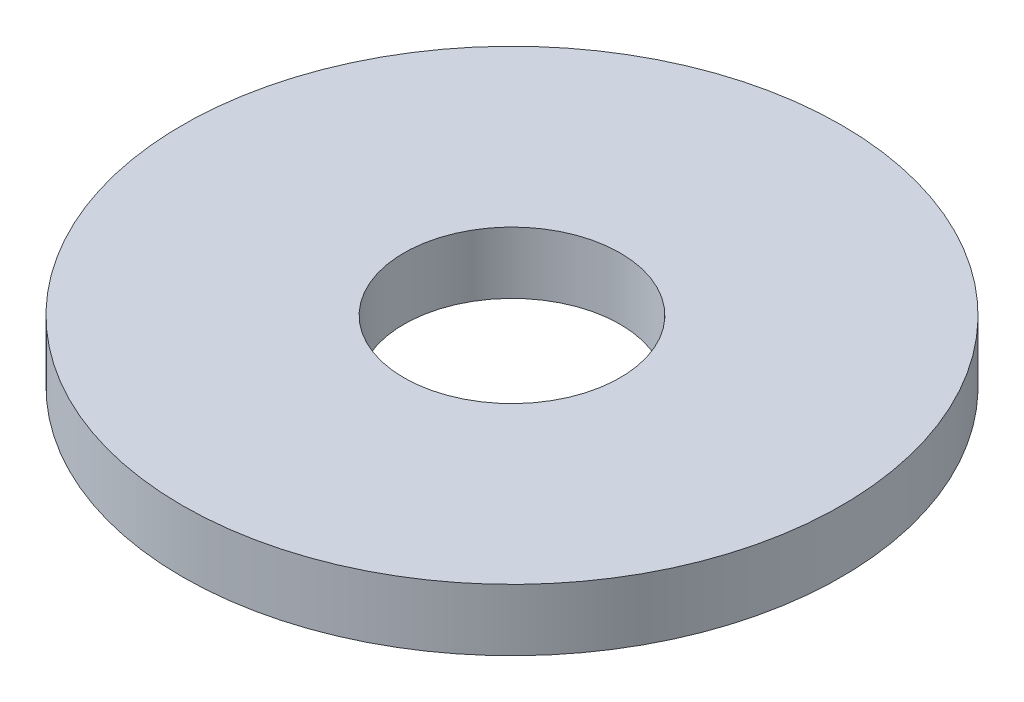
ISO-10303-21;
HEADER;
FILE_DESCRIPTION(('STEP AP214'),'2;1');
FILE_NAME('part.step','',(''),(''),'','','');
FILE_SCHEMA(('AUTOMOTIVE_DESIGN { 1 0 10303 214 1 1 1 1 }'));
ENDSEC;
DATA;
#1=APPLICATION_CONTEXT('core data for automotive mechanical design processes');
#2=APPLICATION_PROTOCOL_DEFINITION('international standard','automotive_design',2000,#1);
#3=PRODUCT_CONTEXT('',#1,'mechanical');
#4=PRODUCT('Part','Part','',(#3));
#5=PRODUCT_RELATED_PRODUCT_CATEGORY('part','',(#4));
#6=PRODUCT_DEFINITION_FORMATION('','',#4);
#7=PRODUCT_DEFINITION_CONTEXT('part definition',#1,'design');
#8=PRODUCT_DEFINITION('design','',#6,#7);
#9=PRODUCT_DEFINITION_SHAPE('','',#8);
#10=(LENGTH_UNIT() NAMED_UNIT(*) SI_UNIT(.MILLI.,.METRE.));
#11=(NAMED_UNIT(*) PLANE_ANGLE_UNIT() SI_UNIT($,.RADIAN.));
#12=(NAMED_UNIT(*) SI_UNIT($,.STERADIAN.) SOLID_ANGLE_UNIT());
#13=UNCERTAINTY_MEASURE_WITH_UNIT(LENGTH_MEASURE(1.E-05),#10,'distance_accuracy_value','');
#14=(GEOMETRIC_REPRESENTATION_CONTEXT(3) GLOBAL_UNCERTAINTY_ASSIGNED_CONTEXT((#13)) GLOBAL_UNIT_ASSIGNED_CONTEXT((#10,
#11,#12)) REPRESENTATION_CONTEXT('',''));
#15=CARTESIAN_POINT('',(0.,0.,0.));
#16=DIRECTION('',(0.,0.,1.));
#17=DIRECTION('',(1.,0.,0.));
#18=AXIS2_PLACEMENT_3D('',#15,#16,#17);
#19=CARTESIAN_POINT('',(0.,9.525,0.));
#20=DIRECTION('',(0.,1.,0.));
#21=DIRECTION('',(0.,0.,1.));
#22=AXIS2_PLACEMENT_3D('',#19,#20,#21);
#23=PLANE('',#22);
#24=CARTESIAN_POINT('',(0.,9.525,0.));
#25=DIRECTION('',(0.,1.,0.));
#26=DIRECTION('',(0.,0.,1.));
#27=AXIS2_PLACEMENT_3D('',#24,#25,#26);
#28=CIRCLE('',#27,50.8);
#29=CARTESIAN_POINT('',(0.,9.525,50.8));
#30=VERTEX_POINT('',#29);
#31=EDGE_CURVE('E10',#30,#30,#28,.T.);
#32=ORIENTED_EDGE('',*,*,#31,.T.);
#33=EDGE_LOOP('',(#32));
#34=FACE_BOUND('',#33,.T.);
#35=CARTESIAN_POINT('',(0.,9.525,0.));
#36=DIRECTION('',(0.,1.,0.));
#37=DIRECTION('',(0.,0.,1.));
#38=AXIS2_PLACEMENT_3D('',#35,#36,#37);
#39=CIRCLE('',#38,16.66875);
#40=CARTESIAN_POINT('',(0.,9.525,16.66875));
#41=VERTEX_POINT('',#40);
#42=EDGE_CURVE('E48',#41,#41,#39,.T.);
#43=ORIENTED_EDGE('',*,*,#42,.F.);
#44=EDGE_LOOP('',(#43));
#45=FACE_BOUND('',#44,.T.);
#46=ADVANCED_FACE('F37',(#34,#45),#23,.T.);
#47=CARTESIAN_POINT('',(0.,0.,0.));
#48=DIRECTION('',(0.,1.,0.));
#49=DIRECTION('',(0.,0.,1.));
#50=AXIS2_PLACEMENT_3D('',#47,#48,#49);
#51=PLANE('',#50);
#52=CARTESIAN_POINT('',(0.,0.,0.));
#53=DIRECTION('',(0.,1.,0.));
#54=DIRECTION('',(0.,0.,1.));
#55=AXIS2_PLACEMENT_3D('',#52,#53,#54);
#56=CIRCLE('',#55,50.8);
#57=CARTESIAN_POINT('',(0.,0.,50.8));
#58=VERTEX_POINT('',#57);
#59=EDGE_CURVE('E41',#58,#58,#56,.T.);
#60=ORIENTED_EDGE('',*,*,#59,.F.);
#61=EDGE_LOOP('',(#60));
#62=FACE_BOUND('',#61,.T.);
#63=CARTESIAN_POINT('',(0.,0.,0.));
#64=DIRECTION('',(0.,1.,0.));
#65=DIRECTION('',(0.,0.,1.));
#66=AXIS2_PLACEMENT_3D('',#63,#64,#65);
#67=CIRCLE('',#66,16.66875);
#68=CARTESIAN_POINT('',(0.,0.,16.66875));
#69=VERTEX_POINT('',#68);
#70=EDGE_CURVE('E50',#69,#69,#67,.T.);
#71=ORIENTED_EDGE('',*,*,#70,.T.);
#72=EDGE_LOOP('',(#71));
#73=FACE_BOUND('',#72,.T.);
#74=ADVANCED_FACE('F60',(#62,#73),#51,.F.);
#75=CARTESIAN_POINT('',(0.,9.525,0.));
#76=DIRECTION('',(0.,-1.,0.));
#77=DIRECTION('',(0.,0.,-1.));
#78=AXIS2_PLACEMENT_3D('',#75,#76,#77);
#79=CYLINDRICAL_SURFACE('',#78,50.8);
#80=ORIENTED_EDGE('',*,*,#31,.F.);
#81=EDGE_LOOP('',(#80));
#82=FACE_BOUND('',#81,.T.);
#83=ORIENTED_EDGE('',*,*,#59,.T.);
#84=EDGE_LOOP('',(#83));
#85=FACE_BOUND('',#84,.T.);
#86=ADVANCED_FACE('F39',(#82,#85),#79,.T.);
#87=CARTESIAN_POINT('',(0.,9.525,0.));
#88=DIRECTION('',(0.,-1.,0.));
#89=DIRECTION('',(0.,0.,-1.));
#90=AXIS2_PLACEMENT_3D('',#87,#88,#89);
#91=CYLINDRICAL_SURFACE('',#90,16.66875);
#92=ORIENTED_EDGE('',*,*,#42,.T.);
#93=EDGE_LOOP('',(#92));
#94=FACE_BOUND('',#93,.T.);
#95=ORIENTED_EDGE('',*,*,#70,.F.);
#96=EDGE_LOOP('',(#95));
#97=FACE_BOUND('',#96,.T.);
#98=ADVANCED_FACE('F56',(#94,#97),#91,.F.);
#99=CLOSED_SHELL('',(#46,#74,#86,#98));
#100=MANIFOLD_SOLID_BREP('B2',#99);
#101=ADVANCED_BREP_SHAPE_REPRESENTATION('',(#18,#100),#14);
#102=SHAPE_DEFINITION_REPRESENTATION(#9,#101);
ENDSEC;
END-ISO-10303-21;
